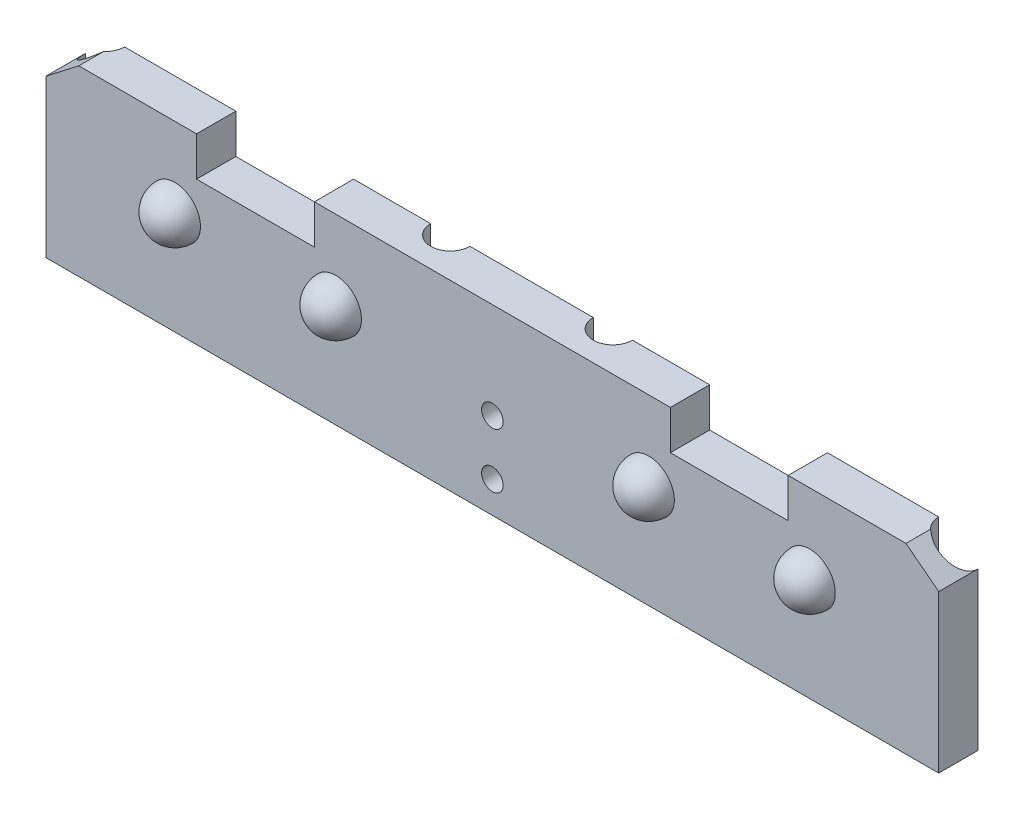
ISO-10303-21;
HEADER;
FILE_DESCRIPTION(('STEP AP214'),'2;1');
FILE_NAME('part.step','',(''),(''),'','','');
FILE_SCHEMA(('AUTOMOTIVE_DESIGN { 1 0 10303 214 1 1 1 1 }'));
ENDSEC;
DATA;
#1=APPLICATION_CONTEXT('core data for automotive mechanical design processes');
#2=APPLICATION_PROTOCOL_DEFINITION('international standard','automotive_design',2000,#1);
#3=PRODUCT_CONTEXT('',#1,'mechanical');
#4=PRODUCT('Part','Part','',(#3));
#5=PRODUCT_RELATED_PRODUCT_CATEGORY('part','',(#4));
#6=PRODUCT_DEFINITION_FORMATION('','',#4);
#7=PRODUCT_DEFINITION_CONTEXT('part definition',#1,'design');
#8=PRODUCT_DEFINITION('design','',#6,#7);
#9=PRODUCT_DEFINITION_SHAPE('','',#8);
#10=(LENGTH_UNIT() NAMED_UNIT(*) SI_UNIT(.MILLI.,.METRE.));
#11=(NAMED_UNIT(*) PLANE_ANGLE_UNIT() SI_UNIT($,.RADIAN.));
#12=(NAMED_UNIT(*) SI_UNIT($,.STERADIAN.) SOLID_ANGLE_UNIT());
#13=UNCERTAINTY_MEASURE_WITH_UNIT(LENGTH_MEASURE(1.E-05),#10,'distance_accuracy_value','');
#14=(GEOMETRIC_REPRESENTATION_CONTEXT(3) GLOBAL_UNCERTAINTY_ASSIGNED_CONTEXT((#13)) GLOBAL_UNIT_ASSIGNED_CONTEXT((#10,
#11,#12)) REPRESENTATION_CONTEXT('',''));
#15=CARTESIAN_POINT('',(0.,0.,0.));
#16=DIRECTION('',(0.,0.,1.));
#17=DIRECTION('',(1.,0.,0.));
#18=AXIS2_PLACEMENT_3D('',#15,#16,#17);
#19=CARTESIAN_POINT('',(0.,0.,0.));
#20=DIRECTION('',(0.,0.,-1.));
#21=DIRECTION('',(-1.,0.,0.));
#22=AXIS2_PLACEMENT_3D('',#19,#20,#21);
#23=PLANE('',#22);
#24=DIRECTION('',(0.,-1.,0.));
#25=VECTOR('',#24,1.);
#26=CARTESIAN_POINT('',(115.2,22.25,0.));
#27=LINE('',#26,#25);
#28=CARTESIAN_POINT('',(115.2,-1.,0.));
#29=VERTEX_POINT('',#28);
#30=CARTESIAN_POINT('',(115.2,22.25,0.));
#31=VERTEX_POINT('',#30);
#32=EDGE_CURVE('E190',#29,#31,#27,.F.);
#33=ORIENTED_EDGE('',*,*,#32,.F.);
#34=DIRECTION('',(1.,0.,0.));
#35=VECTOR('',#34,1.);
#36=CARTESIAN_POINT('',(76.2,-1.,0.));
#37=LINE('',#36,#35);
#38=CARTESIAN_POINT('',(76.2,-1.,0.));
#39=VERTEX_POINT('',#38);
#40=EDGE_CURVE('E208',#39,#29,#37,.T.);
#41=ORIENTED_EDGE('',*,*,#40,.F.);
#42=DIRECTION('',(0.,-1.,0.));
#43=VECTOR('',#42,1.);
#44=CARTESIAN_POINT('',(76.2,22.25,0.));
#45=LINE('',#44,#43);
#46=CARTESIAN_POINT('',(76.2,22.25,0.));
#47=VERTEX_POINT('',#46);
#48=EDGE_CURVE('E278',#47,#39,#45,.T.);
#49=ORIENTED_EDGE('',*,*,#48,.F.);
#50=DIRECTION('',(-1.,0.,0.));
#51=VECTOR('',#50,1.);
#52=CARTESIAN_POINT('',(0.,22.25,0.));
#53=LINE('',#52,#51);
#54=CARTESIAN_POINT('',(86.025,22.25,0.));
#55=VERTEX_POINT('',#54);
#56=EDGE_CURVE('E383',#55,#47,#53,.T.);
#57=ORIENTED_EDGE('',*,*,#56,.F.);
#58=DIRECTION('',(0.,-1.,0.));
#59=VECTOR('',#58,1.);
#60=CARTESIAN_POINT('',(86.025,22.25,0.));
#61=LINE('',#60,#59);
#62=CARTESIAN_POINT('',(86.025,17.25,0.));
#63=VERTEX_POINT('',#62);
#64=EDGE_CURVE('E328',#55,#63,#61,.T.);
#65=ORIENTED_EDGE('',*,*,#64,.T.);
#66=DIRECTION('',(1.,0.,0.));
#67=VECTOR('',#66,1.);
#68=CARTESIAN_POINT('',(101.025,17.25,0.));
#69=LINE('',#68,#67);
#70=CARTESIAN_POINT('',(101.025,17.25,0.));
#71=VERTEX_POINT('',#70);
#72=EDGE_CURVE('E332',#63,#71,#69,.T.);
#73=ORIENTED_EDGE('',*,*,#72,.T.);
#74=DIRECTION('',(0.,1.,0.));
#75=VECTOR('',#74,1.);
#76=CARTESIAN_POINT('',(101.025,22.25,0.));
#77=LINE('',#76,#75);
#78=CARTESIAN_POINT('',(101.025,22.25,0.));
#79=VERTEX_POINT('',#78);
#80=EDGE_CURVE('E295',#71,#79,#77,.T.);
#81=ORIENTED_EDGE('',*,*,#80,.T.);
#82=EDGE_CURVE('E379',#31,#79,#53,.T.);
#83=ORIENTED_EDGE('',*,*,#82,.F.);
#84=EDGE_LOOP('',(#33,#41,#49,#57,#65,#73,#81,#83));
#85=FACE_BOUND('',#84,.T.);
#86=ADVANCED_FACE('F44',(#85),#23,.T.);
#87=DIRECTION('',(0.,-1.,0.));
#88=VECTOR('',#87,1.);
#89=CARTESIAN_POINT('',(71.2,22.25,0.));
#90=LINE('',#89,#88);
#91=CARTESIAN_POINT('',(71.2,-1.,0.));
#92=VERTEX_POINT('',#91);
#93=CARTESIAN_POINT('',(71.2,22.25,0.));
#94=VERTEX_POINT('',#93);
#95=EDGE_CURVE('E66',#92,#94,#90,.F.);
#96=ORIENTED_EDGE('',*,*,#95,.F.);
#97=DIRECTION('',(1.,0.,0.));
#98=VECTOR('',#97,1.);
#99=CARTESIAN_POINT('',(55.5,-1.,0.));
#100=LINE('',#99,#98);
#101=CARTESIAN_POINT('',(55.5,-1.,0.));
#102=VERTEX_POINT('',#101);
#103=EDGE_CURVE('E231',#102,#92,#100,.T.);
#104=ORIENTED_EDGE('',*,*,#103,.F.);
#105=DIRECTION('',(0.,-1.,0.));
#106=VECTOR('',#105,1.);
#107=CARTESIAN_POINT('',(55.5,22.25,0.));
#108=LINE('',#107,#106);
#109=CARTESIAN_POINT('',(55.5,22.25,0.));
#110=VERTEX_POINT('',#109);
#111=EDGE_CURVE('E273',#110,#102,#108,.T.);
#112=ORIENTED_EDGE('',*,*,#111,.F.);
#113=EDGE_CURVE('E436',#94,#110,#53,.T.);
#114=ORIENTED_EDGE('',*,*,#113,.F.);
#115=EDGE_LOOP('',(#96,#104,#112,#114));
#116=FACE_BOUND('',#115,.T.);
#117=CARTESIAN_POINT('',(63.35,3.00000000000001,0.));
#118=DIRECTION('',(0.,0.,1.));
#119=DIRECTION('',(1.,0.,0.));
#120=AXIS2_PLACEMENT_3D('',#117,#118,#119);
#121=CIRCLE('',#120,1.375);
#122=CARTESIAN_POINT('',(64.725,3.00000000000001,0.));
#123=VERTEX_POINT('',#122);
#124=EDGE_CURVE('E382',#123,#123,#121,.T.);
#125=ORIENTED_EDGE('',*,*,#124,.T.);
#126=EDGE_LOOP('',(#125));
#127=FACE_BOUND('',#126,.T.);
#128=CARTESIAN_POINT('',(63.35,10.,0.));
#129=DIRECTION('',(0.,0.,1.));
#130=DIRECTION('',(1.,0.,0.));
#131=AXIS2_PLACEMENT_3D('',#128,#129,#130);
#132=CIRCLE('',#131,1.375);
#133=CARTESIAN_POINT('',(64.725,10.,0.));
#134=VERTEX_POINT('',#133);
#135=EDGE_CURVE('E388',#134,#134,#132,.T.);
#136=ORIENTED_EDGE('',*,*,#135,.T.);
#137=EDGE_LOOP('',(#136));
#138=FACE_BOUND('',#137,.T.);
#139=ADVANCED_FACE('F450',(#116,#127,#138),#23,.T.);
#140=DIRECTION('',(0.,-1.,0.));
#141=VECTOR('',#140,1.);
#142=CARTESIAN_POINT('',(50.5,22.25,0.));
#143=LINE('',#142,#141);
#144=CARTESIAN_POINT('',(50.5,-1.,0.));
#145=VERTEX_POINT('',#144);
#146=CARTESIAN_POINT('',(50.5,22.25,0.));
#147=VERTEX_POINT('',#146);
#148=EDGE_CURVE('E58',#145,#147,#143,.F.);
#149=ORIENTED_EDGE('',*,*,#148,.F.);
#150=DIRECTION('',(1.,0.,0.));
#151=VECTOR('',#150,1.);
#152=CARTESIAN_POINT('',(11.5,-1.,0.));
#153=LINE('',#152,#151);
#154=CARTESIAN_POINT('',(11.5,-1.,0.));
#155=VERTEX_POINT('',#154);
#156=EDGE_CURVE('E223',#155,#145,#153,.T.);
#157=ORIENTED_EDGE('',*,*,#156,.F.);
#158=DIRECTION('',(0.,-1.,0.));
#159=VECTOR('',#158,1.);
#160=CARTESIAN_POINT('',(11.5,22.25,0.));
#161=LINE('',#160,#159);
#162=CARTESIAN_POINT('',(11.5,22.25,0.));
#163=VERTEX_POINT('',#162);
#164=EDGE_CURVE('E268',#163,#155,#161,.T.);
#165=ORIENTED_EDGE('',*,*,#164,.F.);
#166=CARTESIAN_POINT('',(25.675,22.25,0.));
#167=VERTEX_POINT('',#166);
#168=EDGE_CURVE('E377',#167,#163,#53,.T.);
#169=ORIENTED_EDGE('',*,*,#168,.F.);
#170=DIRECTION('',(0.,-1.,0.));
#171=VECTOR('',#170,1.);
#172=CARTESIAN_POINT('',(25.675,22.25,0.));
#173=LINE('',#172,#171);
#174=CARTESIAN_POINT('',(25.675,17.25,0.));
#175=VERTEX_POINT('',#174);
#176=EDGE_CURVE('E296',#167,#175,#173,.T.);
#177=ORIENTED_EDGE('',*,*,#176,.T.);
#178=DIRECTION('',(1.,0.,0.));
#179=VECTOR('',#178,1.);
#180=CARTESIAN_POINT('',(25.675,17.25,0.));
#181=LINE('',#180,#179);
#182=CARTESIAN_POINT('',(40.675,17.25,0.));
#183=VERTEX_POINT('',#182);
#184=EDGE_CURVE('E300',#175,#183,#181,.T.);
#185=ORIENTED_EDGE('',*,*,#184,.T.);
#186=DIRECTION('',(0.,1.,0.));
#187=VECTOR('',#186,1.);
#188=CARTESIAN_POINT('',(40.675,22.25,0.));
#189=LINE('',#188,#187);
#190=CARTESIAN_POINT('',(40.675,22.25,0.));
#191=VERTEX_POINT('',#190);
#192=EDGE_CURVE('E305',#183,#191,#189,.T.);
#193=ORIENTED_EDGE('',*,*,#192,.T.);
#194=EDGE_CURVE('E384',#147,#191,#53,.T.);
#195=ORIENTED_EDGE('',*,*,#194,.F.);
#196=EDGE_LOOP('',(#149,#157,#165,#169,#177,#185,#193,#195));
#197=FACE_BOUND('',#196,.T.);
#198=ADVANCED_FACE('F455',(#197),#23,.T.);
#199=CARTESIAN_POINT('',(0.,22.25,-126.968312976112));
#200=DIRECTION('',(0.,1.,0.));
#201=DIRECTION('',(0.,0.,1.));
#202=AXIS2_PLACEMENT_3D('',#199,#200,#201);
#203=PLANE('',#202);
#204=CARTESIAN_POINT('',(8.99999999999999,22.25,0.));
#205=DIRECTION('',(0.,-1.,0.));
#206=DIRECTION('',(0.,0.,1.));
#207=AXIS2_PLACEMENT_3D('',#204,#205,#206);
#208=CIRCLE('',#207,2.49999999999999);
#209=CARTESIAN_POINT('',(10.675,22.25,1.85590274529673));
#210=VERTEX_POINT('',#209);
#211=EDGE_CURVE('E252',#163,#210,#208,.T.);
#212=ORIENTED_EDGE('',*,*,#211,.T.);
#213=DIRECTION('',(0.,0.,1.));
#214=VECTOR('',#213,1.);
#215=CARTESIAN_POINT('',(10.675,22.25,0.));
#216=LINE('',#215,#214);
#217=CARTESIAN_POINT('',(10.675,22.25,5.));
#218=VERTEX_POINT('',#217);
#219=EDGE_CURVE('E281',#210,#218,#216,.T.);
#220=ORIENTED_EDGE('',*,*,#219,.T.);
#221=DIRECTION('',(-1.,0.,0.));
#222=VECTOR('',#221,1.);
#223=CARTESIAN_POINT('',(0.,22.25,5.));
#224=LINE('',#223,#222);
#225=CARTESIAN_POINT('',(25.675,22.25,5.));
#226=VERTEX_POINT('',#225);
#227=EDGE_CURVE('E373',#226,#218,#224,.T.);
#228=ORIENTED_EDGE('',*,*,#227,.F.);
#229=DIRECTION('',(0.,0.,1.));
#230=VECTOR('',#229,1.);
#231=CARTESIAN_POINT('',(25.675,22.25,0.));
#232=LINE('',#231,#230);
#233=EDGE_CURVE('E310',#167,#226,#232,.T.);
#234=ORIENTED_EDGE('',*,*,#233,.F.);
#235=ORIENTED_EDGE('',*,*,#168,.T.);
#236=EDGE_LOOP('',(#212,#220,#228,#234,#235));
#237=FACE_BOUND('',#236,.T.);
#238=ADVANCED_FACE('F430',(#237),#203,.T.);
#239=CARTESIAN_POINT('',(117.7,22.25,0.));
#240=DIRECTION('',(0.,-1.,0.));
#241=DIRECTION('',(0.,0.,-1.));
#242=AXIS2_PLACEMENT_3D('',#239,#240,#241);
#243=CIRCLE('',#242,2.49999999999999);
#244=CARTESIAN_POINT('',(116.025,22.25,1.85590274529673));
#245=VERTEX_POINT('',#244);
#246=EDGE_CURVE('E191',#245,#31,#243,.T.);
#247=ORIENTED_EDGE('',*,*,#246,.T.);
#248=ORIENTED_EDGE('',*,*,#82,.T.);
#249=DIRECTION('',(0.,0.,1.));
#250=VECTOR('',#249,1.);
#251=CARTESIAN_POINT('',(101.025,22.25,0.));
#252=LINE('',#251,#250);
#253=CARTESIAN_POINT('',(101.025,22.25,5.));
#254=VERTEX_POINT('',#253);
#255=EDGE_CURVE('E336',#79,#254,#252,.T.);
#256=ORIENTED_EDGE('',*,*,#255,.T.);
#257=CARTESIAN_POINT('',(116.025,22.25,5.));
#258=VERTEX_POINT('',#257);
#259=EDGE_CURVE('E374',#258,#254,#224,.T.);
#260=ORIENTED_EDGE('',*,*,#259,.F.);
#261=DIRECTION('',(0.,0.,1.));
#262=VECTOR('',#261,1.);
#263=CARTESIAN_POINT('',(116.025,22.25,0.));
#264=LINE('',#263,#262);
#265=EDGE_CURVE('E282',#245,#258,#264,.T.);
#266=ORIENTED_EDGE('',*,*,#265,.F.);
#267=EDGE_LOOP('',(#247,#248,#256,#260,#266));
#268=FACE_BOUND('',#267,.T.);
#269=ADVANCED_FACE('F496',(#268),#203,.T.);
#270=CARTESIAN_POINT('',(0.,0.,5.));
#271=DIRECTION('',(0.,0.,-1.));
#272=DIRECTION('',(-1.,0.,0.));
#273=AXIS2_PLACEMENT_3D('',#270,#271,#272);
#274=PLANE('',#273);
#275=CARTESIAN_POINT('',(103.775,12.25715266,5.));
#276=DIRECTION('',(0.,0.,-1.));
#277=DIRECTION('',(-1.,0.,0.));
#278=AXIS2_PLACEMENT_3D('',#275,#276,#277);
#279=CIRCLE('',#278,3.25);
#280=CARTESIAN_POINT('',(100.525,12.25715266,5.));
#281=VERTEX_POINT('',#280);
#282=EDGE_CURVE('E412',#281,#281,#279,.F.);
#283=ORIENTED_EDGE('',*,*,#282,.F.);
#284=EDGE_LOOP('',(#283));
#285=FACE_BOUND('',#284,.T.);
#286=CARTESIAN_POINT('',(83.275,12.25715266,5.));
#287=DIRECTION('',(0.,0.,-1.));
#288=DIRECTION('',(-1.,0.,0.));
#289=AXIS2_PLACEMENT_3D('',#286,#287,#288);
#290=CIRCLE('',#289,3.25);
#291=CARTESIAN_POINT('',(80.025,12.25715266,5.));
#292=VERTEX_POINT('',#291);
#293=EDGE_CURVE('E408',#292,#292,#290,.F.);
#294=ORIENTED_EDGE('',*,*,#293,.F.);
#295=EDGE_LOOP('',(#294));
#296=FACE_BOUND('',#295,.T.);
#297=CARTESIAN_POINT('',(22.925,12.25715266,5.));
#298=DIRECTION('',(0.,0.,-1.));
#299=DIRECTION('',(-1.,0.,0.));
#300=AXIS2_PLACEMENT_3D('',#297,#298,#299);
#301=CIRCLE('',#300,3.25);
#302=CARTESIAN_POINT('',(19.675,12.25715266,5.));
#303=VERTEX_POINT('',#302);
#304=EDGE_CURVE('E404',#303,#303,#301,.F.);
#305=ORIENTED_EDGE('',*,*,#304,.F.);
#306=EDGE_LOOP('',(#305));
#307=FACE_BOUND('',#306,.T.);
#308=CARTESIAN_POINT('',(43.425,12.25715266,5.));
#309=DIRECTION('',(0.,0.,-1.));
#310=DIRECTION('',(-1.,0.,0.));
#311=AXIS2_PLACEMENT_3D('',#308,#309,#310);
#312=CIRCLE('',#311,3.25);
#313=CARTESIAN_POINT('',(40.175,12.25715266,5.));
#314=VERTEX_POINT('',#313);
#315=EDGE_CURVE('E400',#314,#314,#312,.F.);
#316=ORIENTED_EDGE('',*,*,#315,.F.);
#317=EDGE_LOOP('',(#316));
#318=FACE_BOUND('',#317,.T.);
#319=CARTESIAN_POINT('',(63.35,3.00000000000001,5.));
#320=DIRECTION('',(0.,0.,-1.));
#321=DIRECTION('',(-1.,0.,0.));
#322=AXIS2_PLACEMENT_3D('',#319,#320,#321);
#323=CIRCLE('',#322,1.375);
#324=CARTESIAN_POINT('',(61.975,3.00000000000001,5.));
#325=VERTEX_POINT('',#324);
#326=EDGE_CURVE('E396',#325,#325,#323,.T.);
#327=ORIENTED_EDGE('',*,*,#326,.T.);
#328=EDGE_LOOP('',(#327));
#329=FACE_BOUND('',#328,.T.);
#330=CARTESIAN_POINT('',(63.35,10.,5.));
#331=DIRECTION('',(0.,0.,-1.));
#332=DIRECTION('',(-1.,0.,0.));
#333=AXIS2_PLACEMENT_3D('',#330,#331,#332);
#334=CIRCLE('',#333,1.375);
#335=CARTESIAN_POINT('',(61.975,10.,5.));
#336=VERTEX_POINT('',#335);
#337=EDGE_CURVE('E392',#336,#336,#334,.T.);
#338=ORIENTED_EDGE('',*,*,#337,.T.);
#339=EDGE_LOOP('',(#338));
#340=FACE_BOUND('',#339,.T.);
#341=DIRECTION('',(0.,-1.,0.));
#342=VECTOR('',#341,1.);
#343=CARTESIAN_POINT('',(6.50000000000001,22.25,5.));
#344=LINE('',#343,#342);
#345=CARTESIAN_POINT('',(6.50000000000001,19.0234192037471,5.));
#346=VERTEX_POINT('',#345);
#347=CARTESIAN_POINT('',(6.50000000000001,-1.,5.));
#348=VERTEX_POINT('',#347);
#349=EDGE_CURVE('E240',#346,#348,#344,.T.);
#350=ORIENTED_EDGE('',*,*,#349,.T.);
#351=DIRECTION('',(-1.,0.,0.));
#352=VECTOR('',#351,1.);
#353=CARTESIAN_POINT('',(120.2,-1.,5.));
#354=LINE('',#353,#352);
#355=CARTESIAN_POINT('',(120.2,-1.,5.));
#356=VERTEX_POINT('',#355);
#357=EDGE_CURVE('E202',#356,#348,#354,.T.);
#358=ORIENTED_EDGE('',*,*,#357,.F.);
#359=DIRECTION('',(0.,-1.,0.));
#360=VECTOR('',#359,1.);
#361=CARTESIAN_POINT('',(120.2,22.25,5.));
#362=LINE('',#361,#360);
#363=CARTESIAN_POINT('',(120.2,19.0234192037471,5.));
#364=VERTEX_POINT('',#363);
#365=EDGE_CURVE('E197',#364,#356,#362,.T.);
#366=ORIENTED_EDGE('',*,*,#365,.F.);
#367=DIRECTION('',(-0.791244247335326,0.611500237987487,0.));
#368=VECTOR('',#367,1.);
#369=CARTESIAN_POINT('',(54.151097589869,70.0682383965882,5.));
#370=LINE('',#369,#368);
#371=EDGE_CURVE('E292',#364,#258,#370,.T.);
#372=ORIENTED_EDGE('',*,*,#371,.T.);
#373=ORIENTED_EDGE('',*,*,#259,.T.);
#374=DIRECTION('',(0.,-1.,0.));
#375=VECTOR('',#374,1.);
#376=CARTESIAN_POINT('',(101.025,0.,5.));
#377=LINE('',#376,#375);
#378=CARTESIAN_POINT('',(101.025,17.25,5.));
#379=VERTEX_POINT('',#378);
#380=EDGE_CURVE('E353',#254,#379,#377,.T.);
#381=ORIENTED_EDGE('',*,*,#380,.T.);
#382=DIRECTION('',(-1.,0.,0.));
#383=VECTOR('',#382,1.);
#384=CARTESIAN_POINT('',(0.,17.25,5.));
#385=LINE('',#384,#383);
#386=CARTESIAN_POINT('',(86.025,17.25,5.));
#387=VERTEX_POINT('',#386);
#388=EDGE_CURVE('E365',#379,#387,#385,.T.);
#389=ORIENTED_EDGE('',*,*,#388,.T.);
#390=DIRECTION('',(0.,1.,0.));
#391=VECTOR('',#390,1.);
#392=CARTESIAN_POINT('',(86.025,2.38767339233448E-13,5.));
#393=LINE('',#392,#391);
#394=CARTESIAN_POINT('',(86.025,22.25,5.));
#395=VERTEX_POINT('',#394);
#396=EDGE_CURVE('E313',#387,#395,#393,.T.);
#397=ORIENTED_EDGE('',*,*,#396,.T.);
#398=CARTESIAN_POINT('',(40.675,22.25,5.));
#399=VERTEX_POINT('',#398);
#400=EDGE_CURVE('E378',#395,#399,#224,.T.);
#401=ORIENTED_EDGE('',*,*,#400,.T.);
#402=DIRECTION('',(0.,-1.,0.));
#403=VECTOR('',#402,1.);
#404=CARTESIAN_POINT('',(40.675,0.,5.));
#405=LINE('',#404,#403);
#406=CARTESIAN_POINT('',(40.675,17.25,5.));
#407=VERTEX_POINT('',#406);
#408=EDGE_CURVE('E357',#399,#407,#405,.T.);
#409=ORIENTED_EDGE('',*,*,#408,.T.);
#410=DIRECTION('',(-1.,0.,0.));
#411=VECTOR('',#410,1.);
#412=CARTESIAN_POINT('',(0.,17.25,5.));
#413=LINE('',#412,#411);
#414=CARTESIAN_POINT('',(25.675,17.25,5.));
#415=VERTEX_POINT('',#414);
#416=EDGE_CURVE('E369',#407,#415,#413,.T.);
#417=ORIENTED_EDGE('',*,*,#416,.T.);
#418=DIRECTION('',(0.,1.,0.));
#419=VECTOR('',#418,1.);
#420=CARTESIAN_POINT('',(25.675,0.,5.));
#421=LINE('',#420,#419);
#422=EDGE_CURVE('E361',#415,#226,#421,.T.);
#423=ORIENTED_EDGE('',*,*,#422,.T.);
#424=ORIENTED_EDGE('',*,*,#227,.T.);
#425=DIRECTION('',(-0.791244247335326,-0.611500237987487,0.));
#426=VECTOR('',#425,1.);
#427=CARTESIAN_POINT('',(-6.77384463772495,8.76494442517745,5.));
#428=LINE('',#427,#426);
#429=EDGE_CURVE('E286',#218,#346,#428,.T.);
#430=ORIENTED_EDGE('',*,*,#429,.T.);
#431=EDGE_LOOP('',(#350,#358,#366,#372,#373,#381,#389,#397,#401,#409,#417,#423,#424,#430));
#432=FACE_BOUND('',#431,.T.);
#433=ADVANCED_FACE('F463',(#285,#296,#307,#318,#329,#340,#432),#274,.F.);
#434=CARTESIAN_POINT('',(63.35,10.,0.));
#435=DIRECTION('',(0.,0.,1.));
#436=DIRECTION('',(1.,0.,0.));
#437=AXIS2_PLACEMENT_3D('',#434,#435,#436);
#438=CYLINDRICAL_SURFACE('',#437,1.375);
#439=ORIENTED_EDGE('',*,*,#135,.F.);
#440=EDGE_LOOP('',(#439));
#441=FACE_BOUND('',#440,.T.);
#442=ORIENTED_EDGE('',*,*,#337,.F.);
#443=EDGE_LOOP('',(#442));
#444=FACE_BOUND('',#443,.T.);
#445=ADVANCED_FACE('F513',(#441,#444),#438,.F.);
#446=CARTESIAN_POINT('',(63.35,3.00000000000001,0.));
#447=DIRECTION('',(0.,0.,1.));
#448=DIRECTION('',(1.,0.,0.));
#449=AXIS2_PLACEMENT_3D('',#446,#447,#448);
#450=CYLINDRICAL_SURFACE('',#449,1.375);
#451=ORIENTED_EDGE('',*,*,#124,.F.);
#452=EDGE_LOOP('',(#451));
#453=FACE_BOUND('',#452,.T.);
#454=ORIENTED_EDGE('',*,*,#326,.F.);
#455=EDGE_LOOP('',(#454));
#456=FACE_BOUND('',#455,.T.);
#457=ADVANCED_FACE('F506',(#453,#456),#450,.F.);
#458=CARTESIAN_POINT('',(73.7,22.25,0.));
#459=DIRECTION('',(0.,-1.,0.));
#460=DIRECTION('',(0.,0.,-1.));
#461=AXIS2_PLACEMENT_3D('',#458,#459,#460);
#462=CIRCLE('',#461,2.49999999999999);
#463=EDGE_CURVE('E256',#47,#94,#462,.T.);
#464=ORIENTED_EDGE('',*,*,#463,.T.);
#465=ORIENTED_EDGE('',*,*,#113,.T.);
#466=CARTESIAN_POINT('',(53.,22.25,0.));
#467=DIRECTION('',(0.,1.,0.));
#468=DIRECTION('',(0.,0.,1.));
#469=AXIS2_PLACEMENT_3D('',#466,#467,#468);
#470=CIRCLE('',#469,2.49999999999999);
#471=EDGE_CURVE('E11',#147,#110,#470,.T.);
#472=ORIENTED_EDGE('',*,*,#471,.F.);
#473=ORIENTED_EDGE('',*,*,#194,.T.);
#474=DIRECTION('',(0.,0.,1.));
#475=VECTOR('',#474,1.);
#476=CARTESIAN_POINT('',(40.675,22.25,0.));
#477=LINE('',#476,#475);
#478=EDGE_CURVE('E314',#191,#399,#477,.T.);
#479=ORIENTED_EDGE('',*,*,#478,.T.);
#480=ORIENTED_EDGE('',*,*,#400,.F.);
#481=DIRECTION('',(0.,0.,1.));
#482=VECTOR('',#481,1.);
#483=CARTESIAN_POINT('',(86.025,22.25,0.));
#484=LINE('',#483,#482);
#485=EDGE_CURVE('E344',#55,#395,#484,.T.);
#486=ORIENTED_EDGE('',*,*,#485,.F.);
#487=ORIENTED_EDGE('',*,*,#56,.T.);
#488=EDGE_LOOP('',(#464,#465,#472,#473,#479,#480,#486,#487));
#489=FACE_BOUND('',#488,.T.);
#490=ADVANCED_FACE('F446',(#489),#203,.T.);
#491=CARTESIAN_POINT('',(43.425,12.25715266,5.));
#492=DIRECTION('',(0.,-1.,0.));
#493=DIRECTION('',(1.,0.,0.));
#494=AXIS2_PLACEMENT_3D('',#491,#492,#493);
#495=SPHERICAL_SURFACE('',#494,3.25);
#496=CARTESIAN_POINT('',(43.425,12.25715266,5.));
#497=DIRECTION('',(0.,0.,-1.));
#498=DIRECTION('',(-1.,0.,0.));
#499=AXIS2_PLACEMENT_3D('',#496,#497,#498);
#500=SPHERICAL_SURFACE('',#499,3.25);
#501=ORIENTED_EDGE('',*,*,#315,.T.);
#502=EDGE_LOOP('',(#501));
#503=FACE_BOUND('',#502,.T.);
#504=ADVANCED_FACE('F505',(#503),#500,.T.);
#505=CARTESIAN_POINT('',(22.925,12.25715266,5.));
#506=DIRECTION('',(0.,1.,0.));
#507=DIRECTION('',(-1.,0.,0.));
#508=AXIS2_PLACEMENT_3D('',#505,#506,#507);
#509=SPHERICAL_SURFACE('',#508,3.25);
#510=CARTESIAN_POINT('',(22.925,12.25715266,5.));
#511=DIRECTION('',(0.,0.,-1.));
#512=DIRECTION('',(-1.,0.,0.));
#513=AXIS2_PLACEMENT_3D('',#510,#511,#512);
#514=SPHERICAL_SURFACE('',#513,3.25);
#515=ORIENTED_EDGE('',*,*,#304,.T.);
#516=EDGE_LOOP('',(#515));
#517=FACE_BOUND('',#516,.T.);
#518=ADVANCED_FACE('F511',(#517),#514,.T.);
#519=CARTESIAN_POINT('',(83.275,12.25715266,5.));
#520=DIRECTION('',(0.,1.,0.));
#521=DIRECTION('',(-1.,0.,0.));
#522=AXIS2_PLACEMENT_3D('',#519,#520,#521);
#523=SPHERICAL_SURFACE('',#522,3.25);
#524=CARTESIAN_POINT('',(83.275,12.25715266,5.));
#525=DIRECTION('',(0.,0.,-1.));
#526=DIRECTION('',(-1.,0.,0.));
#527=AXIS2_PLACEMENT_3D('',#524,#525,#526);
#528=SPHERICAL_SURFACE('',#527,3.25);
#529=ORIENTED_EDGE('',*,*,#293,.T.);
#530=EDGE_LOOP('',(#529));
#531=FACE_BOUND('',#530,.T.);
#532=ADVANCED_FACE('F540',(#531),#528,.T.);
#533=CARTESIAN_POINT('',(103.775,12.25715266,5.));
#534=DIRECTION('',(0.,-1.,0.));
#535=DIRECTION('',(1.,0.,0.));
#536=AXIS2_PLACEMENT_3D('',#533,#534,#535);
#537=SPHERICAL_SURFACE('',#536,3.25);
#538=CARTESIAN_POINT('',(103.775,12.25715266,5.));
#539=DIRECTION('',(0.,0.,-1.));
#540=DIRECTION('',(-1.,0.,0.));
#541=AXIS2_PLACEMENT_3D('',#538,#539,#540);
#542=SPHERICAL_SURFACE('',#541,3.25);
#543=ORIENTED_EDGE('',*,*,#282,.T.);
#544=EDGE_LOOP('',(#543));
#545=FACE_BOUND('',#544,.T.);
#546=ADVANCED_FACE('F545',(#545),#542,.T.);
#547=CARTESIAN_POINT('',(101.025,17.25,0.));
#548=DIRECTION('',(0.,-1.,0.));
#549=DIRECTION('',(1.,0.,0.));
#550=AXIS2_PLACEMENT_3D('',#547,#548,#549);
#551=PLANE('',#550);
#552=DIRECTION('',(0.,0.,1.));
#553=VECTOR('',#552,1.);
#554=CARTESIAN_POINT('',(101.025,17.25,0.));
#555=LINE('',#554,#553);
#556=EDGE_CURVE('E301',#71,#379,#555,.T.);
#557=ORIENTED_EDGE('',*,*,#556,.F.);
#558=ORIENTED_EDGE('',*,*,#72,.F.);
#559=DIRECTION('',(0.,0.,1.));
#560=VECTOR('',#559,1.);
#561=CARTESIAN_POINT('',(86.025,17.25,0.));
#562=LINE('',#561,#560);
#563=EDGE_CURVE('E340',#63,#387,#562,.T.);
#564=ORIENTED_EDGE('',*,*,#563,.T.);
#565=ORIENTED_EDGE('',*,*,#388,.F.);
#566=EDGE_LOOP('',(#557,#558,#564,#565));
#567=FACE_BOUND('',#566,.T.);
#568=ADVANCED_FACE('F551',(#567),#551,.F.);
#569=CARTESIAN_POINT('',(101.025,22.25,0.));
#570=DIRECTION('',(1.,0.,0.));
#571=DIRECTION('',(0.,0.,-1.));
#572=AXIS2_PLACEMENT_3D('',#569,#570,#571);
#573=PLANE('',#572);
#574=ORIENTED_EDGE('',*,*,#255,.F.);
#575=ORIENTED_EDGE('',*,*,#80,.F.);
#576=ORIENTED_EDGE('',*,*,#556,.T.);
#577=ORIENTED_EDGE('',*,*,#380,.F.);
#578=EDGE_LOOP('',(#574,#575,#576,#577));
#579=FACE_BOUND('',#578,.T.);
#580=ADVANCED_FACE('F483',(#579),#573,.F.);
#581=CARTESIAN_POINT('',(86.025,22.25,0.));
#582=DIRECTION('',(-1.,0.,0.));
#583=DIRECTION('',(0.,-1.,0.));
#584=AXIS2_PLACEMENT_3D('',#581,#582,#583);
#585=PLANE('',#584);
#586=ORIENTED_EDGE('',*,*,#563,.F.);
#587=ORIENTED_EDGE('',*,*,#64,.F.);
#588=ORIENTED_EDGE('',*,*,#485,.T.);
#589=ORIENTED_EDGE('',*,*,#396,.F.);
#590=EDGE_LOOP('',(#586,#587,#588,#589));
#591=FACE_BOUND('',#590,.T.);
#592=ADVANCED_FACE('F476',(#591),#585,.F.);
#593=CARTESIAN_POINT('',(25.675,17.25,0.));
#594=DIRECTION('',(0.,-1.,0.));
#595=DIRECTION('',(1.,0.,0.));
#596=AXIS2_PLACEMENT_3D('',#593,#594,#595);
#597=PLANE('',#596);
#598=DIRECTION('',(0.,0.,1.));
#599=VECTOR('',#598,1.);
#600=CARTESIAN_POINT('',(40.675,17.25,0.));
#601=LINE('',#600,#599);
#602=EDGE_CURVE('E318',#183,#407,#601,.T.);
#603=ORIENTED_EDGE('',*,*,#602,.F.);
#604=ORIENTED_EDGE('',*,*,#184,.F.);
#605=DIRECTION('',(0.,0.,1.));
#606=VECTOR('',#605,1.);
#607=CARTESIAN_POINT('',(25.675,17.25,0.));
#608=LINE('',#607,#606);
#609=EDGE_CURVE('E309',#175,#415,#608,.T.);
#610=ORIENTED_EDGE('',*,*,#609,.T.);
#611=ORIENTED_EDGE('',*,*,#416,.F.);
#612=EDGE_LOOP('',(#603,#604,#610,#611));
#613=FACE_BOUND('',#612,.T.);
#614=ADVANCED_FACE('F474',(#613),#597,.F.);
#615=CARTESIAN_POINT('',(25.675,22.25,0.));
#616=DIRECTION('',(-1.,0.,0.));
#617=DIRECTION('',(0.,-1.,0.));
#618=AXIS2_PLACEMENT_3D('',#615,#616,#617);
#619=PLANE('',#618);
#620=ORIENTED_EDGE('',*,*,#609,.F.);
#621=ORIENTED_EDGE('',*,*,#176,.F.);
#622=ORIENTED_EDGE('',*,*,#233,.T.);
#623=ORIENTED_EDGE('',*,*,#422,.F.);
#624=EDGE_LOOP('',(#620,#621,#622,#623));
#625=FACE_BOUND('',#624,.T.);
#626=ADVANCED_FACE('F471',(#625),#619,.F.);
#627=CARTESIAN_POINT('',(40.675,22.25,0.));
#628=DIRECTION('',(1.,0.,0.));
#629=DIRECTION('',(0.,1.,0.));
#630=AXIS2_PLACEMENT_3D('',#627,#628,#629);
#631=PLANE('',#630);
#632=ORIENTED_EDGE('',*,*,#478,.F.);
#633=ORIENTED_EDGE('',*,*,#192,.F.);
#634=ORIENTED_EDGE('',*,*,#602,.T.);
#635=ORIENTED_EDGE('',*,*,#408,.F.);
#636=EDGE_LOOP('',(#632,#633,#634,#635));
#637=FACE_BOUND('',#636,.T.);
#638=ADVANCED_FACE('F461',(#637),#631,.F.);
#639=CARTESIAN_POINT('',(10.675,22.25,0.));
#640=DIRECTION('',(0.611500237987487,-0.791244247335326,0.));
#641=DIRECTION('',(0.791244247335326,0.611500237987487,0.));
#642=AXIS2_PLACEMENT_3D('',#639,#640,#641);
#643=PLANE('',#642);
#644=CARTESIAN_POINT('',(8.99999999999999,20.9555035128806,0.));
#645=DIRECTION('',(0.611500237987487,-0.791244247335326,0.));
#646=DIRECTION('',(-0.791244247335326,-0.611500237987487,0.));
#647=AXIS2_PLACEMENT_3D('',#644,#645,#646);
#648=ELLIPSE('',#647,3.15958063318532,2.49999999999999);
#649=CARTESIAN_POINT('',(6.5,19.0234192037471,0.));
#650=VERTEX_POINT('',#649);
#651=EDGE_CURVE('E52',#210,#650,#648,.T.);
#652=ORIENTED_EDGE('',*,*,#651,.T.);
#653=DIRECTION('',(0.,0.,1.));
#654=VECTOR('',#653,1.);
#655=CARTESIAN_POINT('',(6.50000000000001,19.0234192037471,0.));
#656=LINE('',#655,#654);
#657=EDGE_CURVE('E243',#650,#346,#656,.T.);
#658=ORIENTED_EDGE('',*,*,#657,.T.);
#659=ORIENTED_EDGE('',*,*,#429,.F.);
#660=ORIENTED_EDGE('',*,*,#219,.F.);
#661=EDGE_LOOP('',(#652,#658,#659,#660));
#662=FACE_BOUND('',#661,.T.);
#663=ADVANCED_FACE('F422',(#662),#643,.F.);
#664=CARTESIAN_POINT('',(116.025,22.25,0.));
#665=DIRECTION('',(-0.611500237987487,-0.791244247335326,0.));
#666=DIRECTION('',(0.791244247335326,-0.611500237987487,0.));
#667=AXIS2_PLACEMENT_3D('',#664,#665,#666);
#668=PLANE('',#667);
#669=ORIENTED_EDGE('',*,*,#371,.F.);
#670=DIRECTION('',(0.,0.,-1.));
#671=VECTOR('',#670,1.);
#672=CARTESIAN_POINT('',(120.2,19.0234192037471,0.));
#673=LINE('',#672,#671);
#674=CARTESIAN_POINT('',(120.2,19.0234192037471,0.));
#675=VERTEX_POINT('',#674);
#676=EDGE_CURVE('E249',#364,#675,#673,.T.);
#677=ORIENTED_EDGE('',*,*,#676,.T.);
#678=CARTESIAN_POINT('',(117.7,20.9555035128806,0.));
#679=DIRECTION('',(-0.611500237987487,-0.791244247335326,0.));
#680=DIRECTION('',(0.791244247335326,-0.611500237987487,0.));
#681=AXIS2_PLACEMENT_3D('',#678,#679,#680);
#682=ELLIPSE('',#681,3.15958063318532,2.49999999999999);
#683=EDGE_CURVE('E186',#675,#245,#682,.T.);
#684=ORIENTED_EDGE('',*,*,#683,.T.);
#685=ORIENTED_EDGE('',*,*,#265,.T.);
#686=EDGE_LOOP('',(#669,#677,#684,#685));
#687=FACE_BOUND('',#686,.T.);
#688=ADVANCED_FACE('F571',(#687),#668,.F.);
#689=CARTESIAN_POINT('',(117.7,22.25,0.));
#690=DIRECTION('',(0.,-1.,0.));
#691=DIRECTION('',(0.,0.,-1.));
#692=AXIS2_PLACEMENT_3D('',#689,#690,#691);
#693=CYLINDRICAL_SURFACE('',#692,2.49999999999999);
#694=ORIENTED_EDGE('',*,*,#32,.T.);
#695=ORIENTED_EDGE('',*,*,#246,.F.);
#696=ORIENTED_EDGE('',*,*,#683,.F.);
#697=DIRECTION('',(0.,-1.,0.));
#698=VECTOR('',#697,1.);
#699=CARTESIAN_POINT('',(120.2,22.25,0.));
#700=LINE('',#699,#698);
#701=CARTESIAN_POINT('',(120.2,-1.,0.));
#702=VERTEX_POINT('',#701);
#703=EDGE_CURVE('E180',#675,#702,#700,.T.);
#704=ORIENTED_EDGE('',*,*,#703,.T.);
#705=CARTESIAN_POINT('',(117.7,-1.,0.));
#706=DIRECTION('',(0.,1.,0.));
#707=DIRECTION('',(0.,0.,-1.));
#708=AXIS2_PLACEMENT_3D('',#705,#706,#707);
#709=CIRCLE('',#708,2.49999999999999);
#710=EDGE_CURVE('E184',#29,#702,#709,.T.);
#711=ORIENTED_EDGE('',*,*,#710,.F.);
#712=EDGE_LOOP('',(#694,#695,#696,#704,#711));
#713=FACE_BOUND('',#712,.T.);
#714=ADVANCED_FACE('F182',(#713),#693,.F.);
#715=CARTESIAN_POINT('',(8.99999999999999,22.25,0.));
#716=DIRECTION('',(0.,-1.,0.));
#717=DIRECTION('',(0.,0.,-1.));
#718=AXIS2_PLACEMENT_3D('',#715,#716,#717);
#719=CYLINDRICAL_SURFACE('',#718,2.49999999999999);
#720=ORIENTED_EDGE('',*,*,#164,.T.);
#721=CARTESIAN_POINT('',(8.99999999999999,-1.,0.));
#722=DIRECTION('',(0.,1.,0.));
#723=DIRECTION('',(0.,0.,-1.));
#724=AXIS2_PLACEMENT_3D('',#721,#722,#723);
#725=CIRCLE('',#724,2.49999999999999);
#726=CARTESIAN_POINT('',(6.5,-1.,0.));
#727=VERTEX_POINT('',#726);
#728=EDGE_CURVE('E219',#727,#155,#725,.T.);
#729=ORIENTED_EDGE('',*,*,#728,.F.);
#730=DIRECTION('',(0.,-1.,0.));
#731=VECTOR('',#730,1.);
#732=CARTESIAN_POINT('',(6.5,22.25,0.));
#733=LINE('',#732,#731);
#734=EDGE_CURVE('E264',#727,#650,#733,.F.);
#735=ORIENTED_EDGE('',*,*,#734,.T.);
#736=ORIENTED_EDGE('',*,*,#651,.F.);
#737=ORIENTED_EDGE('',*,*,#211,.F.);
#738=EDGE_LOOP('',(#720,#729,#735,#736,#737));
#739=FACE_BOUND('',#738,.T.);
#740=ADVANCED_FACE('F425',(#739),#719,.F.);
#741=CARTESIAN_POINT('',(53.,22.25,0.));
#742=DIRECTION('',(0.,-1.,0.));
#743=DIRECTION('',(0.,0.,-1.));
#744=AXIS2_PLACEMENT_3D('',#741,#742,#743);
#745=CYLINDRICAL_SURFACE('',#744,2.49999999999999);
#746=ORIENTED_EDGE('',*,*,#111,.T.);
#747=CARTESIAN_POINT('',(53.,-1.,0.));
#748=DIRECTION('',(0.,1.,0.));
#749=DIRECTION('',(0.,0.,-1.));
#750=AXIS2_PLACEMENT_3D('',#747,#748,#749);
#751=CIRCLE('',#750,2.5);
#752=EDGE_CURVE('E227',#145,#102,#751,.T.);
#753=ORIENTED_EDGE('',*,*,#752,.F.);
#754=ORIENTED_EDGE('',*,*,#148,.T.);
#755=ORIENTED_EDGE('',*,*,#471,.T.);
#756=EDGE_LOOP('',(#746,#753,#754,#755));
#757=FACE_BOUND('',#756,.T.);
#758=ADVANCED_FACE('F453',(#757),#745,.F.);
#759=CARTESIAN_POINT('',(73.7,22.25,0.));
#760=DIRECTION('',(0.,-1.,0.));
#761=DIRECTION('',(0.,0.,-1.));
#762=AXIS2_PLACEMENT_3D('',#759,#760,#761);
#763=CYLINDRICAL_SURFACE('',#762,2.49999999999999);
#764=ORIENTED_EDGE('',*,*,#48,.T.);
#765=CARTESIAN_POINT('',(73.7,-1.,0.));
#766=DIRECTION('',(0.,1.,0.));
#767=DIRECTION('',(0.,0.,-1.));
#768=AXIS2_PLACEMENT_3D('',#765,#766,#767);
#769=CIRCLE('',#768,2.49999999999999);
#770=EDGE_CURVE('E235',#92,#39,#769,.T.);
#771=ORIENTED_EDGE('',*,*,#770,.F.);
#772=ORIENTED_EDGE('',*,*,#95,.T.);
#773=ORIENTED_EDGE('',*,*,#463,.F.);
#774=EDGE_LOOP('',(#764,#771,#772,#773));
#775=FACE_BOUND('',#774,.T.);
#776=ADVANCED_FACE('F576',(#775),#763,.F.);
#777=CARTESIAN_POINT('',(6.50000000000001,22.25,5.));
#778=DIRECTION('',(1.,0.,0.));
#779=DIRECTION('',(0.,0.,-1.));
#780=AXIS2_PLACEMENT_3D('',#777,#778,#779);
#781=PLANE('',#780);
#782=ORIENTED_EDGE('',*,*,#349,.F.);
#783=ORIENTED_EDGE('',*,*,#657,.F.);
#784=ORIENTED_EDGE('',*,*,#734,.F.);
#785=DIRECTION('',(0.,0.,-1.));
#786=VECTOR('',#785,1.);
#787=CARTESIAN_POINT('',(6.50000000000001,-1.,5.));
#788=LINE('',#787,#786);
#789=EDGE_CURVE('E215',#348,#727,#788,.T.);
#790=ORIENTED_EDGE('',*,*,#789,.F.);
#791=EDGE_LOOP('',(#782,#783,#784,#790));
#792=FACE_BOUND('',#791,.T.);
#793=ADVANCED_FACE('F574',(#792),#781,.F.);
#794=CARTESIAN_POINT('',(120.2,22.25,5.));
#795=DIRECTION('',(-1.,0.,0.));
#796=DIRECTION('',(0.,0.,1.));
#797=AXIS2_PLACEMENT_3D('',#794,#795,#796);
#798=PLANE('',#797);
#799=ORIENTED_EDGE('',*,*,#703,.F.);
#800=ORIENTED_EDGE('',*,*,#676,.F.);
#801=ORIENTED_EDGE('',*,*,#365,.T.);
#802=DIRECTION('',(0.,0.,1.));
#803=VECTOR('',#802,1.);
#804=CARTESIAN_POINT('',(120.2,-1.,0.));
#805=LINE('',#804,#803);
#806=EDGE_CURVE('E194',#702,#356,#805,.T.);
#807=ORIENTED_EDGE('',*,*,#806,.F.);
#808=EDGE_LOOP('',(#799,#800,#801,#807));
#809=FACE_BOUND('',#808,.T.);
#810=ADVANCED_FACE('F195',(#809),#798,.F.);
#811=CARTESIAN_POINT('',(117.7,-1.,0.));
#812=DIRECTION('',(0.,-1.,0.));
#813=DIRECTION('',(0.,0.,-1.));
#814=AXIS2_PLACEMENT_3D('',#811,#812,#813);
#815=PLANE('',#814);
#816=ORIENTED_EDGE('',*,*,#710,.T.);
#817=ORIENTED_EDGE('',*,*,#806,.T.);
#818=ORIENTED_EDGE('',*,*,#357,.T.);
#819=ORIENTED_EDGE('',*,*,#789,.T.);
#820=ORIENTED_EDGE('',*,*,#728,.T.);
#821=ORIENTED_EDGE('',*,*,#156,.T.);
#822=ORIENTED_EDGE('',*,*,#752,.T.);
#823=ORIENTED_EDGE('',*,*,#103,.T.);
#824=ORIENTED_EDGE('',*,*,#770,.T.);
#825=ORIENTED_EDGE('',*,*,#40,.T.);
#826=EDGE_LOOP('',(#816,#817,#818,#819,#820,#821,#822,#823,#824,#825));
#827=FACE_BOUND('',#826,.T.);
#828=ADVANCED_FACE('F205',(#827),#815,.T.);
#829=CLOSED_SHELL('',(#86,#139,#198,#238,#269,#433,#445,#457,#490,#504,#518,#532,#546,#568,#580,
#592,#614,#626,#638,#663,#688,#714,#740,#758,#776,#793,#810,#828));
#830=MANIFOLD_SOLID_BREP('B2',#829);
#831=ADVANCED_BREP_SHAPE_REPRESENTATION('',(#18,#830),#14);
#832=SHAPE_DEFINITION_REPRESENTATION(#9,#831);
ENDSEC;
END-ISO-10303-21;
